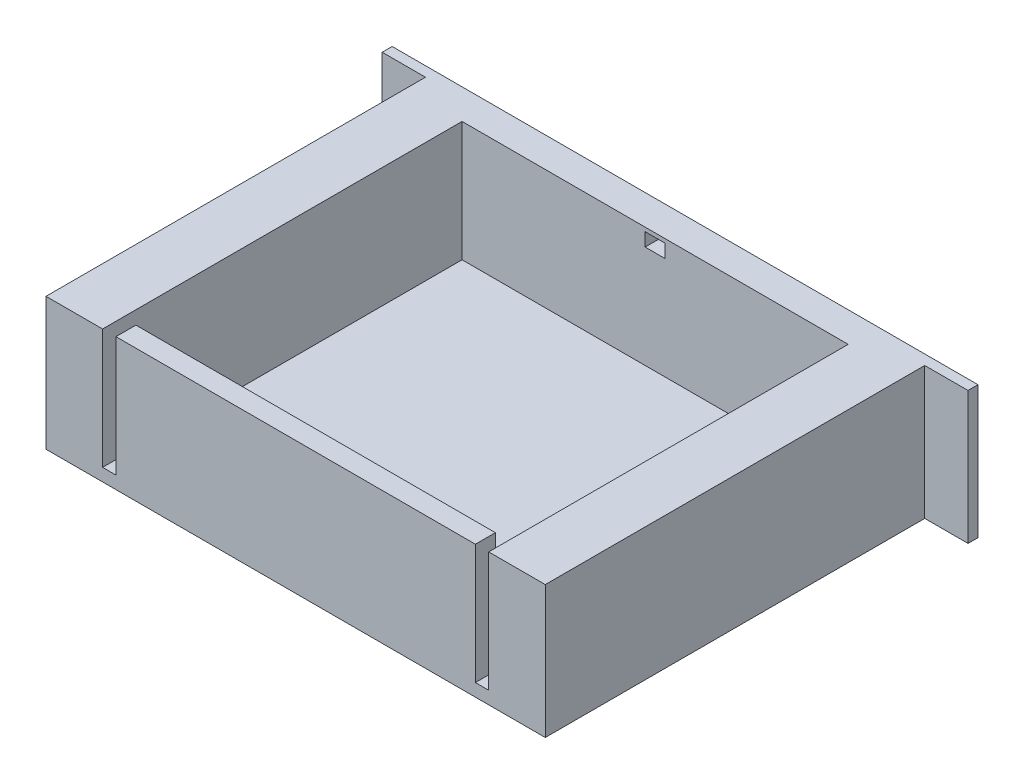
ISO-10303-21;
HEADER;
FILE_DESCRIPTION(('STEP AP214'),'2;1');
FILE_NAME('part.step','',(''),(''),'','','');
FILE_SCHEMA(('AUTOMOTIVE_DESIGN { 1 0 10303 214 1 1 1 1 }'));
ENDSEC;
DATA;
#1=APPLICATION_CONTEXT('core data for automotive mechanical design processes');
#2=APPLICATION_PROTOCOL_DEFINITION('international standard','automotive_design',2000,#1);
#3=PRODUCT_CONTEXT('',#1,'mechanical');
#4=PRODUCT('Part','Part','',(#3));
#5=PRODUCT_RELATED_PRODUCT_CATEGORY('part','',(#4));
#6=PRODUCT_DEFINITION_FORMATION('','',#4);
#7=PRODUCT_DEFINITION_CONTEXT('part definition',#1,'design');
#8=PRODUCT_DEFINITION('design','',#6,#7);
#9=PRODUCT_DEFINITION_SHAPE('','',#8);
#10=(LENGTH_UNIT() NAMED_UNIT(*) SI_UNIT(.MILLI.,.METRE.));
#11=(NAMED_UNIT(*) PLANE_ANGLE_UNIT() SI_UNIT($,.RADIAN.));
#12=(NAMED_UNIT(*) SI_UNIT($,.STERADIAN.) SOLID_ANGLE_UNIT());
#13=UNCERTAINTY_MEASURE_WITH_UNIT(LENGTH_MEASURE(1.E-05),#10,'distance_accuracy_value','');
#14=(GEOMETRIC_REPRESENTATION_CONTEXT(3) GLOBAL_UNCERTAINTY_ASSIGNED_CONTEXT((#13)) GLOBAL_UNIT_ASSIGNED_CONTEXT((#10,
#11,#12)) REPRESENTATION_CONTEXT('',''));
#15=CARTESIAN_POINT('',(0.,0.,0.));
#16=DIRECTION('',(0.,0.,1.));
#17=DIRECTION('',(1.,0.,0.));
#18=AXIS2_PLACEMENT_3D('',#15,#16,#17);
#19=CARTESIAN_POINT('',(-37.5031973116039,3.,-1.49999999999999));
#20=DIRECTION('',(0.,-1.,0.));
#21=DIRECTION('',(1.,0.,0.));
#22=AXIS2_PLACEMENT_3D('',#19,#20,#21);
#23=CYLINDRICAL_SURFACE('',#22,7.5);
#24=CARTESIAN_POINT('',(-37.5031973116039,0.,-1.49999999999999));
#25=DIRECTION('',(0.,-1.,0.));
#26=DIRECTION('',(-1.,0.,0.));
#27=AXIS2_PLACEMENT_3D('',#24,#25,#26);
#28=CIRCLE('',#27,7.5);
#29=CARTESIAN_POINT('',(-45.0031973116039,0.,-1.5));
#30=VERTEX_POINT('',#29);
#31=CARTESIAN_POINT('',(-30.0031973116039,0.,-1.49999999999999));
#32=VERTEX_POINT('',#31);
#33=EDGE_CURVE('E109',#30,#32,#28,.T.);
#34=ORIENTED_EDGE('',*,*,#33,.F.);
#35=DIRECTION('',(0.,-1.,0.));
#36=VECTOR('',#35,1.);
#37=CARTESIAN_POINT('',(-45.0031973116039,2.99999999999999,-1.5));
#38=LINE('',#37,#36);
#39=CARTESIAN_POINT('',(-45.0031973116039,2.99999999999999,-1.5));
#40=VERTEX_POINT('',#39);
#41=EDGE_CURVE('E12',#40,#30,#38,.T.);
#42=ORIENTED_EDGE('',*,*,#41,.F.);
#43=CARTESIAN_POINT('',(-37.5031973116039,3.,-1.49999999999999));
#44=DIRECTION('',(0.,-1.,0.));
#45=DIRECTION('',(-1.,0.,0.));
#46=AXIS2_PLACEMENT_3D('',#43,#44,#45);
#47=CIRCLE('',#46,7.5);
#48=CARTESIAN_POINT('',(-30.0031973116039,3.,-1.49999999999999));
#49=VERTEX_POINT('',#48);
#50=EDGE_CURVE('E103',#40,#49,#47,.T.);
#51=ORIENTED_EDGE('',*,*,#50,.T.);
#52=DIRECTION('',(0.,-1.,0.));
#53=VECTOR('',#52,1.);
#54=CARTESIAN_POINT('',(-30.0031973116039,3.,-1.49999999999999));
#55=LINE('',#54,#53);
#56=EDGE_CURVE('E48',#49,#32,#55,.T.);
#57=ORIENTED_EDGE('',*,*,#56,.T.);
#58=EDGE_LOOP('',(#34,#42,#51,#57));
#59=FACE_BOUND('',#58,.T.);
#60=ADVANCED_FACE('F45',(#59),#23,.T.);
#61=CARTESIAN_POINT('',(-42.5031973116039,2.99999999999999,-1.5));
#62=DIRECTION('',(0.,0.,1.));
#63=DIRECTION('',(1.,0.,0.));
#64=AXIS2_PLACEMENT_3D('',#61,#62,#63);
#65=PLANE('',#64);
#66=DIRECTION('',(-1.,0.,0.));
#67=VECTOR('',#66,1.);
#68=CARTESIAN_POINT('',(-42.5031973116039,0.,-1.5));
#69=LINE('',#68,#67);
#70=CARTESIAN_POINT('',(-42.5031973116039,0.,-1.49999999999999));
#71=VERTEX_POINT('',#70);
#72=EDGE_CURVE('E105',#71,#30,#69,.T.);
#73=ORIENTED_EDGE('',*,*,#72,.F.);
#74=DIRECTION('',(0.,-1.,0.));
#75=VECTOR('',#74,1.);
#76=CARTESIAN_POINT('',(-42.5031973116039,2.99999999999999,-1.49999999999999));
#77=LINE('',#76,#75);
#78=CARTESIAN_POINT('',(-42.5031973116039,2.99999999999999,-1.49999999999999));
#79=VERTEX_POINT('',#78);
#80=EDGE_CURVE('E54',#79,#71,#77,.T.);
#81=ORIENTED_EDGE('',*,*,#80,.F.);
#82=DIRECTION('',(-1.,0.,0.));
#83=VECTOR('',#82,1.);
#84=CARTESIAN_POINT('',(-42.5031973116039,2.99999999999999,-1.5));
#85=LINE('',#84,#83);
#86=EDGE_CURVE('E100',#79,#40,#85,.T.);
#87=ORIENTED_EDGE('',*,*,#86,.T.);
#88=ORIENTED_EDGE('',*,*,#41,.T.);
#89=EDGE_LOOP('',(#73,#81,#87,#88));
#90=FACE_BOUND('',#89,.T.);
#91=ADVANCED_FACE('F119',(#90),#65,.T.);
#92=CARTESIAN_POINT('',(-37.5031973116039,3.,-1.49999999999999));
#93=DIRECTION('',(0.,-1.,0.));
#94=DIRECTION('',(1.,0.,0.));
#95=AXIS2_PLACEMENT_3D('',#92,#93,#94);
#96=CYLINDRICAL_SURFACE('',#95,5.);
#97=CARTESIAN_POINT('',(-37.5031973116039,0.,-1.49999999999999));
#98=DIRECTION('',(0.,1.,0.));
#99=DIRECTION('',(-1.,0.,0.));
#100=AXIS2_PLACEMENT_3D('',#97,#98,#99);
#101=CIRCLE('',#100,5.);
#102=CARTESIAN_POINT('',(-32.5031973116039,0.,-1.49999999999999));
#103=VERTEX_POINT('',#102);
#104=EDGE_CURVE('E95',#103,#71,#101,.T.);
#105=ORIENTED_EDGE('',*,*,#104,.F.);
#106=DIRECTION('',(0.,-1.,0.));
#107=VECTOR('',#106,1.);
#108=CARTESIAN_POINT('',(-32.5031973116039,3.,-1.49999999999999));
#109=LINE('',#108,#107);
#110=CARTESIAN_POINT('',(-32.5031973116039,3.,-1.49999999999999));
#111=VERTEX_POINT('',#110);
#112=EDGE_CURVE('E90',#111,#103,#109,.T.);
#113=ORIENTED_EDGE('',*,*,#112,.F.);
#114=CARTESIAN_POINT('',(-37.5031973116039,3.,-1.49999999999999));
#115=DIRECTION('',(0.,1.,0.));
#116=DIRECTION('',(-1.,0.,0.));
#117=AXIS2_PLACEMENT_3D('',#114,#115,#116);
#118=CIRCLE('',#117,5.);
#119=EDGE_CURVE('E93',#111,#79,#118,.T.);
#120=ORIENTED_EDGE('',*,*,#119,.T.);
#121=ORIENTED_EDGE('',*,*,#80,.T.);
#122=EDGE_LOOP('',(#105,#113,#120,#121));
#123=FACE_BOUND('',#122,.T.);
#124=ADVANCED_FACE('F92',(#123),#96,.F.);
#125=CARTESIAN_POINT('',(-30.0031973116039,3.,-1.49999999999999));
#126=DIRECTION('',(0.,0.,1.));
#127=DIRECTION('',(1.,0.,0.));
#128=AXIS2_PLACEMENT_3D('',#125,#126,#127);
#129=PLANE('',#128);
#130=DIRECTION('',(-1.,0.,0.));
#131=VECTOR('',#130,1.);
#132=CARTESIAN_POINT('',(-30.0031973116039,0.,-1.49999999999999));
#133=LINE('',#132,#131);
#134=EDGE_CURVE('E112',#32,#103,#133,.T.);
#135=ORIENTED_EDGE('',*,*,#134,.F.);
#136=ORIENTED_EDGE('',*,*,#56,.F.);
#137=DIRECTION('',(-1.,0.,0.));
#138=VECTOR('',#137,1.);
#139=CARTESIAN_POINT('',(-30.0031973116039,3.,-1.49999999999999));
#140=LINE('',#139,#138);
#141=EDGE_CURVE('E99',#49,#111,#140,.T.);
#142=ORIENTED_EDGE('',*,*,#141,.T.);
#143=ORIENTED_EDGE('',*,*,#112,.T.);
#144=EDGE_LOOP('',(#135,#136,#142,#143));
#145=FACE_BOUND('',#144,.T.);
#146=ADVANCED_FACE('F102',(#145),#129,.T.);
#147=CARTESIAN_POINT('',(-37.5031973116039,3.,-1.49999999999999));
#148=DIRECTION('',(0.,1.,0.));
#149=DIRECTION('',(-1.,0.,0.));
#150=AXIS2_PLACEMENT_3D('',#147,#148,#149);
#151=PLANE('',#150);
#152=ORIENTED_EDGE('',*,*,#50,.F.);
#153=ORIENTED_EDGE('',*,*,#86,.F.);
#154=ORIENTED_EDGE('',*,*,#119,.F.);
#155=ORIENTED_EDGE('',*,*,#141,.F.);
#156=EDGE_LOOP('',(#152,#153,#154,#155));
#157=FACE_BOUND('',#156,.T.);
#158=ADVANCED_FACE('F98',(#157),#151,.T.);
#159=CARTESIAN_POINT('',(-37.5031973116039,0.,-1.49999999999999));
#160=DIRECTION('',(0.,1.,0.));
#161=DIRECTION('',(-1.,0.,0.));
#162=AXIS2_PLACEMENT_3D('',#159,#160,#161);
#163=PLANE('',#162);
#164=ORIENTED_EDGE('',*,*,#33,.T.);
#165=ORIENTED_EDGE('',*,*,#134,.T.);
#166=ORIENTED_EDGE('',*,*,#104,.T.);
#167=ORIENTED_EDGE('',*,*,#72,.T.);
#168=EDGE_LOOP('',(#164,#165,#166,#167));
#169=FACE_BOUND('',#168,.T.);
#170=ADVANCED_FACE('F118',(#169),#163,.F.);
#171=CLOSED_SHELL('',(#60,#91,#124,#146,#158,#170));
#172=MANIFOLD_SOLID_BREP('B2',#171);
#173=CARTESIAN_POINT('',(0.,19.9,57.));
#174=DIRECTION('',(0.,-1.,0.));
#175=DIRECTION('',(1.,0.,0.));
#176=AXIS2_PLACEMENT_3D('',#173,#174,#175);
#177=PLANE('',#176);
#178=DIRECTION('',(0.,0.,-1.));
#179=VECTOR('',#178,1.);
#180=CARTESIAN_POINT('',(-8.5,19.9,54.));
#181=LINE('',#180,#179);
#182=CARTESIAN_POINT('',(-8.5,19.9,57.));
#183=VERTEX_POINT('',#182);
#184=CARTESIAN_POINT('',(-8.49999999999999,19.9,3.));
#185=VERTEX_POINT('',#184);
#186=EDGE_CURVE('E341',#183,#185,#181,.T.);
#187=ORIENTED_EDGE('',*,*,#186,.F.);
#188=DIRECTION('',(-1.,0.,0.));
#189=VECTOR('',#188,1.);
#190=CARTESIAN_POINT('',(0.,19.9,57.));
#191=LINE('',#190,#189);
#192=CARTESIAN_POINT('',(0.,19.9,57.));
#193=VERTEX_POINT('',#192);
#194=EDGE_CURVE('E430',#193,#183,#191,.T.);
#195=ORIENTED_EDGE('',*,*,#194,.F.);
#196=DIRECTION('',(0.,0.,-1.));
#197=VECTOR('',#196,1.);
#198=CARTESIAN_POINT('',(0.,19.9,57.));
#199=LINE('',#198,#197);
#200=CARTESIAN_POINT('',(0.,19.9,0.));
#201=VERTEX_POINT('',#200);
#202=EDGE_CURVE('E43',#193,#201,#199,.T.);
#203=ORIENTED_EDGE('',*,*,#202,.T.);
#204=DIRECTION('',(1.,0.,0.));
#205=VECTOR('',#204,1.);
#206=CARTESIAN_POINT('',(6.5,19.9,0.));
#207=LINE('',#206,#205);
#208=CARTESIAN_POINT('',(6.5,19.9,0.));
#209=VERTEX_POINT('',#208);
#210=EDGE_CURVE('E410',#201,#209,#207,.T.);
#211=ORIENTED_EDGE('',*,*,#210,.T.);
#212=DIRECTION('',(0.,0.,1.));
#213=VECTOR('',#212,1.);
#214=CARTESIAN_POINT('',(6.5,19.9,-1.5));
#215=LINE('',#214,#213);
#216=CARTESIAN_POINT('',(6.5,19.9,-1.5));
#217=VERTEX_POINT('',#216);
#218=EDGE_CURVE('E401',#217,#209,#215,.T.);
#219=ORIENTED_EDGE('',*,*,#218,.F.);
#220=DIRECTION('',(1.,0.,0.));
#221=VECTOR('',#220,1.);
#222=CARTESIAN_POINT('',(6.5,19.9,-1.5));
#223=LINE('',#222,#221);
#224=CARTESIAN_POINT('',(-81.5,19.9,-1.5));
#225=VERTEX_POINT('',#224);
#226=EDGE_CURVE('E399',#225,#217,#223,.T.);
#227=ORIENTED_EDGE('',*,*,#226,.F.);
#228=DIRECTION('',(0.,0.,1.));
#229=VECTOR('',#228,1.);
#230=CARTESIAN_POINT('',(-81.5,19.9,-1.5));
#231=LINE('',#230,#229);
#232=CARTESIAN_POINT('',(-81.5,19.9,0.));
#233=VERTEX_POINT('',#232);
#234=EDGE_CURVE('E415',#225,#233,#231,.T.);
#235=ORIENTED_EDGE('',*,*,#234,.T.);
#236=CARTESIAN_POINT('',(-75.,19.9,0.));
#237=VERTEX_POINT('',#236);
#238=EDGE_CURVE('E395',#233,#237,#207,.T.);
#239=ORIENTED_EDGE('',*,*,#238,.T.);
#240=DIRECTION('',(0.,0.,-1.));
#241=VECTOR('',#240,1.);
#242=CARTESIAN_POINT('',(-75.,19.9,57.));
#243=LINE('',#242,#241);
#244=CARTESIAN_POINT('',(-75.,19.9,57.));
#245=VERTEX_POINT('',#244);
#246=EDGE_CURVE('E177',#245,#237,#243,.T.);
#247=ORIENTED_EDGE('',*,*,#246,.F.);
#248=CARTESIAN_POINT('',(-66.5,19.9,57.));
#249=VERTEX_POINT('',#248);
#250=EDGE_CURVE('E428',#249,#245,#191,.T.);
#251=ORIENTED_EDGE('',*,*,#250,.F.);
#252=DIRECTION('',(0.,0.,1.));
#253=VECTOR('',#252,1.);
#254=CARTESIAN_POINT('',(-66.5,19.9,54.));
#255=LINE('',#254,#253);
#256=CARTESIAN_POINT('',(-66.5,19.9,3.));
#257=VERTEX_POINT('',#256);
#258=EDGE_CURVE('E382',#257,#249,#255,.T.);
#259=ORIENTED_EDGE('',*,*,#258,.F.);
#260=DIRECTION('',(-1.,0.,0.));
#261=VECTOR('',#260,1.);
#262=CARTESIAN_POINT('',(-8.49999999999999,19.9,3.));
#263=LINE('',#262,#261);
#264=EDGE_CURVE('E379',#185,#257,#263,.T.);
#265=ORIENTED_EDGE('',*,*,#264,.F.);
#266=EDGE_LOOP('',(#187,#195,#203,#211,#219,#227,#235,#239,#247,#251,#259,#265));
#267=FACE_BOUND('',#266,.T.);
#268=ADVANCED_FACE('F169',(#267),#177,.F.);
#269=CARTESIAN_POINT('',(0.,0.,57.));
#270=DIRECTION('',(-1.,0.,0.));
#271=DIRECTION('',(0.,-1.,0.));
#272=AXIS2_PLACEMENT_3D('',#269,#270,#271);
#273=PLANE('',#272);
#274=DIRECTION('',(0.,1.,0.));
#275=VECTOR('',#274,1.);
#276=CARTESIAN_POINT('',(0.,0.,0.));
#277=LINE('',#276,#275);
#278=CARTESIAN_POINT('',(0.,0.,0.));
#279=VERTEX_POINT('',#278);
#280=EDGE_CURVE('E424',#279,#201,#277,.T.);
#281=ORIENTED_EDGE('',*,*,#280,.T.);
#282=ORIENTED_EDGE('',*,*,#202,.F.);
#283=DIRECTION('',(0.,1.,0.));
#284=VECTOR('',#283,1.);
#285=CARTESIAN_POINT('',(0.,0.,57.));
#286=LINE('',#285,#284);
#287=CARTESIAN_POINT('',(0.,0.,57.));
#288=VERTEX_POINT('',#287);
#289=EDGE_CURVE('E425',#288,#193,#286,.T.);
#290=ORIENTED_EDGE('',*,*,#289,.F.);
#291=DIRECTION('',(0.,0.,-1.));
#292=VECTOR('',#291,1.);
#293=CARTESIAN_POINT('',(0.,0.,57.));
#294=LINE('',#293,#292);
#295=EDGE_CURVE('E438',#288,#279,#294,.T.);
#296=ORIENTED_EDGE('',*,*,#295,.T.);
#297=EDGE_LOOP('',(#281,#282,#290,#296));
#298=FACE_BOUND('',#297,.T.);
#299=ADVANCED_FACE('F171',(#298),#273,.F.);
#300=CARTESIAN_POINT('',(-10.5,19.9,57.));
#301=VERTEX_POINT('',#300);
#302=CARTESIAN_POINT('',(-64.5,19.9,57.));
#303=VERTEX_POINT('',#302);
#304=EDGE_CURVE('E434',#301,#303,#191,.T.);
#305=ORIENTED_EDGE('',*,*,#304,.F.);
#306=DIRECTION('',(0.,0.,1.));
#307=VECTOR('',#306,1.);
#308=CARTESIAN_POINT('',(-10.5,19.9,54.));
#309=LINE('',#308,#307);
#310=CARTESIAN_POINT('',(-10.5,19.9,54.));
#311=VERTEX_POINT('',#310);
#312=EDGE_CURVE('E342',#311,#301,#309,.T.);
#313=ORIENTED_EDGE('',*,*,#312,.F.);
#314=DIRECTION('',(1.,0.,0.));
#315=VECTOR('',#314,1.);
#316=CARTESIAN_POINT('',(-8.5,19.9,54.));
#317=LINE('',#316,#315);
#318=CARTESIAN_POINT('',(-64.5,19.9,54.));
#319=VERTEX_POINT('',#318);
#320=EDGE_CURVE('E369',#319,#311,#317,.T.);
#321=ORIENTED_EDGE('',*,*,#320,.F.);
#322=DIRECTION('',(0.,0.,-1.));
#323=VECTOR('',#322,1.);
#324=CARTESIAN_POINT('',(-64.5,19.9,54.));
#325=LINE('',#324,#323);
#326=EDGE_CURVE('E334',#303,#319,#325,.T.);
#327=ORIENTED_EDGE('',*,*,#326,.F.);
#328=EDGE_LOOP('',(#305,#313,#321,#327));
#329=FACE_BOUND('',#328,.T.);
#330=ADVANCED_FACE('F494',(#329),#177,.F.);
#331=CARTESIAN_POINT('',(-75.,0.,57.));
#332=DIRECTION('',(1.,0.,0.));
#333=DIRECTION('',(0.,0.,-1.));
#334=AXIS2_PLACEMENT_3D('',#331,#332,#333);
#335=PLANE('',#334);
#336=DIRECTION('',(0.,-1.,0.));
#337=VECTOR('',#336,1.);
#338=CARTESIAN_POINT('',(-75.,0.,0.));
#339=LINE('',#338,#337);
#340=CARTESIAN_POINT('',(-75.,0.,0.));
#341=VERTEX_POINT('',#340);
#342=EDGE_CURVE('E429',#237,#341,#339,.T.);
#343=ORIENTED_EDGE('',*,*,#342,.T.);
#344=DIRECTION('',(0.,0.,-1.));
#345=VECTOR('',#344,1.);
#346=CARTESIAN_POINT('',(-75.,0.,57.));
#347=LINE('',#346,#345);
#348=CARTESIAN_POINT('',(-75.,0.,57.));
#349=VERTEX_POINT('',#348);
#350=EDGE_CURVE('E445',#349,#341,#347,.T.);
#351=ORIENTED_EDGE('',*,*,#350,.F.);
#352=DIRECTION('',(0.,-1.,0.));
#353=VECTOR('',#352,1.);
#354=CARTESIAN_POINT('',(-75.,0.,57.));
#355=LINE('',#354,#353);
#356=EDGE_CURVE('E433',#245,#349,#355,.T.);
#357=ORIENTED_EDGE('',*,*,#356,.F.);
#358=ORIENTED_EDGE('',*,*,#246,.T.);
#359=EDGE_LOOP('',(#343,#351,#357,#358));
#360=FACE_BOUND('',#359,.T.);
#361=ADVANCED_FACE('F451',(#360),#335,.F.);
#362=CARTESIAN_POINT('',(0.,0.,57.));
#363=DIRECTION('',(0.,1.,0.));
#364=DIRECTION('',(-1.,0.,0.));
#365=AXIS2_PLACEMENT_3D('',#362,#363,#364);
#366=PLANE('',#365);
#367=ORIENTED_EDGE('',*,*,#350,.T.);
#368=DIRECTION('',(-1.,0.,0.));
#369=VECTOR('',#368,1.);
#370=CARTESIAN_POINT('',(6.5,0.,0.));
#371=LINE('',#370,#369);
#372=CARTESIAN_POINT('',(-81.5,0.,0.));
#373=VERTEX_POINT('',#372);
#374=EDGE_CURVE('E404',#341,#373,#371,.T.);
#375=ORIENTED_EDGE('',*,*,#374,.T.);
#376=DIRECTION('',(0.,0.,1.));
#377=VECTOR('',#376,1.);
#378=CARTESIAN_POINT('',(-81.5,0.,-1.5));
#379=LINE('',#378,#377);
#380=CARTESIAN_POINT('',(-81.5,0.,-1.5));
#381=VERTEX_POINT('',#380);
#382=EDGE_CURVE('E418',#381,#373,#379,.T.);
#383=ORIENTED_EDGE('',*,*,#382,.F.);
#384=DIRECTION('',(-1.,0.,0.));
#385=VECTOR('',#384,1.);
#386=CARTESIAN_POINT('',(6.5,0.,-1.5));
#387=LINE('',#386,#385);
#388=CARTESIAN_POINT('',(6.5,0.,-1.5));
#389=VERTEX_POINT('',#388);
#390=EDGE_CURVE('E394',#389,#381,#387,.T.);
#391=ORIENTED_EDGE('',*,*,#390,.F.);
#392=DIRECTION('',(0.,0.,1.));
#393=VECTOR('',#392,1.);
#394=CARTESIAN_POINT('',(6.5,0.,-1.5));
#395=LINE('',#394,#393);
#396=CARTESIAN_POINT('',(6.5,0.,0.));
#397=VERTEX_POINT('',#396);
#398=EDGE_CURVE('E421',#389,#397,#395,.T.);
#399=ORIENTED_EDGE('',*,*,#398,.T.);
#400=EDGE_CURVE('E405',#397,#279,#371,.T.);
#401=ORIENTED_EDGE('',*,*,#400,.T.);
#402=ORIENTED_EDGE('',*,*,#295,.F.);
#403=DIRECTION('',(1.,0.,0.));
#404=VECTOR('',#403,1.);
#405=CARTESIAN_POINT('',(0.,0.,57.));
#406=LINE('',#405,#404);
#407=EDGE_CURVE('E436',#349,#288,#406,.T.);
#408=ORIENTED_EDGE('',*,*,#407,.F.);
#409=EDGE_LOOP('',(#367,#375,#383,#391,#399,#401,#402,#408));
#410=FACE_BOUND('',#409,.T.);
#411=ADVANCED_FACE('F464',(#410),#366,.F.);
#412=CARTESIAN_POINT('',(0.,0.,57.));
#413=DIRECTION('',(0.,0.,1.));
#414=DIRECTION('',(1.,0.,0.));
#415=AXIS2_PLACEMENT_3D('',#412,#413,#414);
#416=PLANE('',#415);
#417=DIRECTION('',(0.,1.,0.));
#418=VECTOR('',#417,1.);
#419=CARTESIAN_POINT('',(-8.5,-1.70555127546398,57.));
#420=LINE('',#419,#418);
#421=CARTESIAN_POINT('',(-8.5,1.9,57.));
#422=VERTEX_POINT('',#421);
#423=EDGE_CURVE('E338',#422,#183,#420,.T.);
#424=ORIENTED_EDGE('',*,*,#423,.F.);
#425=DIRECTION('',(-1.,0.,0.));
#426=VECTOR('',#425,1.);
#427=CARTESIAN_POINT('',(-8.5,1.9,57.));
#428=LINE('',#427,#426);
#429=CARTESIAN_POINT('',(-10.5,1.9,57.));
#430=VERTEX_POINT('',#429);
#431=EDGE_CURVE('E337',#422,#430,#428,.T.);
#432=ORIENTED_EDGE('',*,*,#431,.T.);
#433=DIRECTION('',(0.,1.,0.));
#434=VECTOR('',#433,1.);
#435=CARTESIAN_POINT('',(-10.5,-1.70555127546398,57.));
#436=LINE('',#435,#434);
#437=EDGE_CURVE('E348',#430,#301,#436,.T.);
#438=ORIENTED_EDGE('',*,*,#437,.T.);
#439=ORIENTED_EDGE('',*,*,#304,.T.);
#440=DIRECTION('',(0.,1.,0.));
#441=VECTOR('',#440,1.);
#442=CARTESIAN_POINT('',(-64.5,-1.70555127546398,57.));
#443=LINE('',#442,#441);
#444=CARTESIAN_POINT('',(-64.5,1.90000000000001,57.));
#445=VERTEX_POINT('',#444);
#446=EDGE_CURVE('E361',#445,#303,#443,.T.);
#447=ORIENTED_EDGE('',*,*,#446,.F.);
#448=DIRECTION('',(-1.,0.,0.));
#449=VECTOR('',#448,1.);
#450=CARTESIAN_POINT('',(-66.5,1.90000000000001,57.));
#451=LINE('',#450,#449);
#452=CARTESIAN_POINT('',(-66.5,1.90000000000001,57.));
#453=VERTEX_POINT('',#452);
#454=EDGE_CURVE('E352',#445,#453,#451,.T.);
#455=ORIENTED_EDGE('',*,*,#454,.T.);
#456=DIRECTION('',(0.,1.,0.));
#457=VECTOR('',#456,1.);
#458=CARTESIAN_POINT('',(-66.5,-1.70555127546398,57.));
#459=LINE('',#458,#457);
#460=EDGE_CURVE('E358',#453,#249,#459,.T.);
#461=ORIENTED_EDGE('',*,*,#460,.T.);
#462=ORIENTED_EDGE('',*,*,#250,.T.);
#463=ORIENTED_EDGE('',*,*,#356,.T.);
#464=ORIENTED_EDGE('',*,*,#407,.T.);
#465=ORIENTED_EDGE('',*,*,#289,.T.);
#466=ORIENTED_EDGE('',*,*,#194,.T.);
#467=EDGE_LOOP('',(#424,#432,#438,#439,#447,#455,#461,#462,#463,#464,#465,#466));
#468=FACE_BOUND('',#467,.T.);
#469=ADVANCED_FACE('F485',(#468),#416,.T.);
#470=CARTESIAN_POINT('',(0.,0.,0.));
#471=DIRECTION('',(0.,0.,-1.));
#472=DIRECTION('',(-1.,0.,0.));
#473=AXIS2_PLACEMENT_3D('',#470,#471,#472);
#474=PLANE('',#473);
#475=ORIENTED_EDGE('',*,*,#280,.F.);
#476=ORIENTED_EDGE('',*,*,#400,.F.);
#477=DIRECTION('',(0.,-1.,0.));
#478=VECTOR('',#477,1.);
#479=CARTESIAN_POINT('',(6.5,19.9,0.));
#480=LINE('',#479,#478);
#481=EDGE_CURVE('E388',#209,#397,#480,.T.);
#482=ORIENTED_EDGE('',*,*,#481,.F.);
#483=ORIENTED_EDGE('',*,*,#210,.F.);
#484=EDGE_LOOP('',(#475,#476,#482,#483));
#485=FACE_BOUND('',#484,.T.);
#486=ADVANCED_FACE('F479',(#485),#474,.F.);
#487=CARTESIAN_POINT('',(6.5,19.9,-1.5));
#488=DIRECTION('',(-1.,0.,0.));
#489=DIRECTION('',(0.,-1.,0.));
#490=AXIS2_PLACEMENT_3D('',#487,#488,#489);
#491=PLANE('',#490);
#492=ORIENTED_EDGE('',*,*,#481,.T.);
#493=ORIENTED_EDGE('',*,*,#398,.F.);
#494=DIRECTION('',(0.,-1.,0.));
#495=VECTOR('',#494,1.);
#496=CARTESIAN_POINT('',(6.5,19.9,-1.5));
#497=LINE('',#496,#495);
#498=EDGE_CURVE('E391',#217,#389,#497,.T.);
#499=ORIENTED_EDGE('',*,*,#498,.F.);
#500=ORIENTED_EDGE('',*,*,#218,.T.);
#501=EDGE_LOOP('',(#492,#493,#499,#500));
#502=FACE_BOUND('',#501,.T.);
#503=ADVANCED_FACE('F477',(#502),#491,.F.);
#504=CARTESIAN_POINT('',(-81.5,19.9,-1.5));
#505=DIRECTION('',(1.,0.,0.));
#506=DIRECTION('',(0.,0.,-1.));
#507=AXIS2_PLACEMENT_3D('',#504,#505,#506);
#508=PLANE('',#507);
#509=DIRECTION('',(0.,1.,0.));
#510=VECTOR('',#509,1.);
#511=CARTESIAN_POINT('',(-81.5,19.9,0.));
#512=LINE('',#511,#510);
#513=EDGE_CURVE('E408',#373,#233,#512,.T.);
#514=ORIENTED_EDGE('',*,*,#513,.T.);
#515=ORIENTED_EDGE('',*,*,#234,.F.);
#516=DIRECTION('',(0.,1.,0.));
#517=VECTOR('',#516,1.);
#518=CARTESIAN_POINT('',(-81.5,19.9,-1.5));
#519=LINE('',#518,#517);
#520=EDGE_CURVE('E397',#381,#225,#519,.T.);
#521=ORIENTED_EDGE('',*,*,#520,.F.);
#522=ORIENTED_EDGE('',*,*,#382,.T.);
#523=EDGE_LOOP('',(#514,#515,#521,#522));
#524=FACE_BOUND('',#523,.T.);
#525=ADVANCED_FACE('F468',(#524),#508,.F.);
#526=CARTESIAN_POINT('',(0.,0.,-1.5));
#527=DIRECTION('',(0.,0.,-1.));
#528=DIRECTION('',(-1.,0.,0.));
#529=AXIS2_PLACEMENT_3D('',#526,#527,#528);
#530=PLANE('',#529);
#531=DIRECTION('',(-1.,0.,0.));
#532=VECTOR('',#531,1.);
#533=CARTESIAN_POINT('',(-36.,17.3058398665404,-1.5));
#534=LINE('',#533,#532);
#535=CARTESIAN_POINT('',(-36.,17.3058398665404,-1.5));
#536=VERTEX_POINT('',#535);
#537=CARTESIAN_POINT('',(-39.,17.3058398665404,-1.5));
#538=VERTEX_POINT('',#537);
#539=EDGE_CURVE('E550',#536,#538,#534,.T.);
#540=ORIENTED_EDGE('',*,*,#539,.F.);
#541=DIRECTION('',(0.,-1.,0.));
#542=VECTOR('',#541,1.);
#543=CARTESIAN_POINT('',(-36.,19.3058398665404,-1.5));
#544=LINE('',#543,#542);
#545=CARTESIAN_POINT('',(-36.,19.3058398665404,-1.5));
#546=VERTEX_POINT('',#545);
#547=EDGE_CURVE('E326',#546,#536,#544,.T.);
#548=ORIENTED_EDGE('',*,*,#547,.F.);
#549=DIRECTION('',(1.,0.,0.));
#550=VECTOR('',#549,1.);
#551=CARTESIAN_POINT('',(-36.,19.3058398665404,-1.5));
#552=LINE('',#551,#550);
#553=CARTESIAN_POINT('',(-39.,19.3058398665404,-1.5));
#554=VERTEX_POINT('',#553);
#555=EDGE_CURVE('E184',#554,#546,#552,.T.);
#556=ORIENTED_EDGE('',*,*,#555,.F.);
#557=DIRECTION('',(0.,1.,0.));
#558=VECTOR('',#557,1.);
#559=CARTESIAN_POINT('',(-39.,19.3058398665404,-1.5));
#560=LINE('',#559,#558);
#561=EDGE_CURVE('E552',#538,#554,#560,.T.);
#562=ORIENTED_EDGE('',*,*,#561,.F.);
#563=EDGE_LOOP('',(#540,#548,#556,#562));
#564=FACE_BOUND('',#563,.T.);
#565=ORIENTED_EDGE('',*,*,#498,.T.);
#566=ORIENTED_EDGE('',*,*,#390,.T.);
#567=ORIENTED_EDGE('',*,*,#520,.T.);
#568=ORIENTED_EDGE('',*,*,#226,.T.);
#569=EDGE_LOOP('',(#565,#566,#567,#568));
#570=FACE_BOUND('',#569,.T.);
#571=ADVANCED_FACE('F470',(#564,#570),#530,.T.);
#572=ORIENTED_EDGE('',*,*,#342,.F.);
#573=ORIENTED_EDGE('',*,*,#238,.F.);
#574=ORIENTED_EDGE('',*,*,#513,.F.);
#575=ORIENTED_EDGE('',*,*,#374,.F.);
#576=EDGE_LOOP('',(#572,#573,#574,#575));
#577=FACE_BOUND('',#576,.T.);
#578=ADVANCED_FACE('F461',(#577),#474,.F.);
#579=CARTESIAN_POINT('',(-8.5,1.9,54.));
#580=DIRECTION('',(1.,0.,0.));
#581=DIRECTION('',(0.,0.,-1.));
#582=AXIS2_PLACEMENT_3D('',#579,#580,#581);
#583=PLANE('',#582);
#584=ORIENTED_EDGE('',*,*,#186,.T.);
#585=DIRECTION('',(0.,1.,0.));
#586=VECTOR('',#585,1.);
#587=CARTESIAN_POINT('',(-8.49999999999999,1.9,3.));
#588=LINE('',#587,#586);
#589=CARTESIAN_POINT('',(-8.49999999999999,1.9,3.));
#590=VERTEX_POINT('',#589);
#591=EDGE_CURVE('E377',#590,#185,#588,.T.);
#592=ORIENTED_EDGE('',*,*,#591,.F.);
#593=DIRECTION('',(0.,0.,-1.));
#594=VECTOR('',#593,1.);
#595=CARTESIAN_POINT('',(-8.5,1.9,54.));
#596=LINE('',#595,#594);
#597=EDGE_CURVE('E365',#422,#590,#596,.T.);
#598=ORIENTED_EDGE('',*,*,#597,.F.);
#599=ORIENTED_EDGE('',*,*,#423,.T.);
#600=EDGE_LOOP('',(#584,#592,#598,#599));
#601=FACE_BOUND('',#600,.T.);
#602=ADVANCED_FACE('F513',(#601),#583,.F.);
#603=CARTESIAN_POINT('',(-8.5,1.9,54.));
#604=DIRECTION('',(0.,0.,1.));
#605=DIRECTION('',(1.,0.,0.));
#606=AXIS2_PLACEMENT_3D('',#603,#604,#605);
#607=PLANE('',#606);
#608=ORIENTED_EDGE('',*,*,#320,.T.);
#609=DIRECTION('',(0.,1.,0.));
#610=VECTOR('',#609,1.);
#611=CARTESIAN_POINT('',(-10.5,-1.70555127546398,54.));
#612=LINE('',#611,#610);
#613=CARTESIAN_POINT('',(-10.5,1.9,54.));
#614=VERTEX_POINT('',#613);
#615=EDGE_CURVE('E344',#614,#311,#612,.T.);
#616=ORIENTED_EDGE('',*,*,#615,.F.);
#617=DIRECTION('',(1.,0.,0.));
#618=VECTOR('',#617,1.);
#619=CARTESIAN_POINT('',(-8.5,1.9,54.));
#620=LINE('',#619,#618);
#621=CARTESIAN_POINT('',(-64.5,1.90000000000001,54.));
#622=VERTEX_POINT('',#621);
#623=EDGE_CURVE('E374',#622,#614,#620,.T.);
#624=ORIENTED_EDGE('',*,*,#623,.F.);
#625=DIRECTION('',(0.,1.,0.));
#626=VECTOR('',#625,1.);
#627=CARTESIAN_POINT('',(-64.5,-1.70555127546398,54.));
#628=LINE('',#627,#626);
#629=EDGE_CURVE('E355',#622,#319,#628,.T.);
#630=ORIENTED_EDGE('',*,*,#629,.T.);
#631=EDGE_LOOP('',(#608,#616,#624,#630));
#632=FACE_BOUND('',#631,.T.);
#633=ADVANCED_FACE('F501',(#632),#607,.F.);
#634=CARTESIAN_POINT('',(-66.5,1.90000000000001,54.));
#635=DIRECTION('',(-1.,0.,0.));
#636=DIRECTION('',(0.,-1.,0.));
#637=AXIS2_PLACEMENT_3D('',#634,#635,#636);
#638=PLANE('',#637);
#639=ORIENTED_EDGE('',*,*,#258,.T.);
#640=ORIENTED_EDGE('',*,*,#460,.F.);
#641=DIRECTION('',(0.,0.,1.));
#642=VECTOR('',#641,1.);
#643=CARTESIAN_POINT('',(-66.5,1.90000000000001,54.));
#644=LINE('',#643,#642);
#645=CARTESIAN_POINT('',(-66.5,1.90000000000001,3.));
#646=VERTEX_POINT('',#645);
#647=EDGE_CURVE('E372',#646,#453,#644,.T.);
#648=ORIENTED_EDGE('',*,*,#647,.F.);
#649=DIRECTION('',(0.,1.,0.));
#650=VECTOR('',#649,1.);
#651=CARTESIAN_POINT('',(-66.5,1.90000000000001,3.));
#652=LINE('',#651,#650);
#653=EDGE_CURVE('E386',#646,#257,#652,.T.);
#654=ORIENTED_EDGE('',*,*,#653,.T.);
#655=EDGE_LOOP('',(#639,#640,#648,#654));
#656=FACE_BOUND('',#655,.T.);
#657=ADVANCED_FACE('F510',(#656),#638,.F.);
#658=CARTESIAN_POINT('',(-8.49999999999999,1.9,3.));
#659=DIRECTION('',(0.,0.,-1.));
#660=DIRECTION('',(-1.,0.,0.));
#661=AXIS2_PLACEMENT_3D('',#658,#659,#660);
#662=PLANE('',#661);
#663=DIRECTION('',(0.,1.,0.));
#664=VECTOR('',#663,1.);
#665=CARTESIAN_POINT('',(-36.,19.3058398665404,3.));
#666=LINE('',#665,#664);
#667=CARTESIAN_POINT('',(-36.,17.3058398665404,3.));
#668=VERTEX_POINT('',#667);
#669=CARTESIAN_POINT('',(-36.,19.3058398665404,3.00000000000001));
#670=VERTEX_POINT('',#669);
#671=EDGE_CURVE('E317',#668,#670,#666,.T.);
#672=ORIENTED_EDGE('',*,*,#671,.F.);
#673=DIRECTION('',(1.,0.,0.));
#674=VECTOR('',#673,1.);
#675=CARTESIAN_POINT('',(-36.,17.3058398665404,3.));
#676=LINE('',#675,#674);
#677=CARTESIAN_POINT('',(-39.,17.3058398665404,3.00000000000001));
#678=VERTEX_POINT('',#677);
#679=EDGE_CURVE('E192',#678,#668,#676,.T.);
#680=ORIENTED_EDGE('',*,*,#679,.F.);
#681=DIRECTION('',(0.,-1.,0.));
#682=VECTOR('',#681,1.);
#683=CARTESIAN_POINT('',(-39.,19.3058398665404,3.));
#684=LINE('',#683,#682);
#685=CARTESIAN_POINT('',(-39.,19.3058398665404,3.00000000000001));
#686=VERTEX_POINT('',#685);
#687=EDGE_CURVE('E324',#686,#678,#684,.T.);
#688=ORIENTED_EDGE('',*,*,#687,.F.);
#689=DIRECTION('',(-1.,0.,0.));
#690=VECTOR('',#689,1.);
#691=CARTESIAN_POINT('',(-36.,19.3058398665404,3.));
#692=LINE('',#691,#690);
#693=EDGE_CURVE('E308',#670,#686,#692,.T.);
#694=ORIENTED_EDGE('',*,*,#693,.F.);
#695=EDGE_LOOP('',(#672,#680,#688,#694));
#696=FACE_BOUND('',#695,.T.);
#697=ORIENTED_EDGE('',*,*,#264,.T.);
#698=ORIENTED_EDGE('',*,*,#653,.F.);
#699=DIRECTION('',(-1.,0.,0.));
#700=VECTOR('',#699,1.);
#701=CARTESIAN_POINT('',(-8.49999999999999,1.9,3.));
#702=LINE('',#701,#700);
#703=EDGE_CURVE('E368',#590,#646,#702,.T.);
#704=ORIENTED_EDGE('',*,*,#703,.F.);
#705=ORIENTED_EDGE('',*,*,#591,.T.);
#706=EDGE_LOOP('',(#697,#698,#704,#705));
#707=FACE_BOUND('',#706,.T.);
#708=ADVANCED_FACE('F321',(#696,#707),#662,.F.);
#709=CARTESIAN_POINT('',(0.,1.9,0.));
#710=DIRECTION('',(0.,1.,0.));
#711=DIRECTION('',(-1.,0.,0.));
#712=AXIS2_PLACEMENT_3D('',#709,#710,#711);
#713=PLANE('',#712);
#714=ORIENTED_EDGE('',*,*,#597,.T.);
#715=ORIENTED_EDGE('',*,*,#703,.T.);
#716=ORIENTED_EDGE('',*,*,#647,.T.);
#717=ORIENTED_EDGE('',*,*,#454,.F.);
#718=DIRECTION('',(0.,0.,1.));
#719=VECTOR('',#718,1.);
#720=CARTESIAN_POINT('',(-64.5,1.90000000000001,54.));
#721=LINE('',#720,#719);
#722=EDGE_CURVE('E345',#622,#445,#721,.T.);
#723=ORIENTED_EDGE('',*,*,#722,.F.);
#724=ORIENTED_EDGE('',*,*,#623,.T.);
#725=DIRECTION('',(0.,0.,-1.));
#726=VECTOR('',#725,1.);
#727=CARTESIAN_POINT('',(-10.5,1.9,54.));
#728=LINE('',#727,#726);
#729=EDGE_CURVE('E335',#430,#614,#728,.T.);
#730=ORIENTED_EDGE('',*,*,#729,.F.);
#731=ORIENTED_EDGE('',*,*,#431,.F.);
#732=EDGE_LOOP('',(#714,#715,#716,#717,#723,#724,#730,#731));
#733=FACE_BOUND('',#732,.T.);
#734=ADVANCED_FACE('F504',(#733),#713,.T.);
#735=CARTESIAN_POINT('',(-64.5,-1.70555127546398,54.));
#736=DIRECTION('',(1.,0.,0.));
#737=DIRECTION('',(0.,1.,0.));
#738=AXIS2_PLACEMENT_3D('',#735,#736,#737);
#739=PLANE('',#738);
#740=ORIENTED_EDGE('',*,*,#722,.T.);
#741=ORIENTED_EDGE('',*,*,#446,.T.);
#742=ORIENTED_EDGE('',*,*,#326,.T.);
#743=ORIENTED_EDGE('',*,*,#629,.F.);
#744=EDGE_LOOP('',(#740,#741,#742,#743));
#745=FACE_BOUND('',#744,.T.);
#746=ADVANCED_FACE('F497',(#745),#739,.F.);
#747=CARTESIAN_POINT('',(-10.5,-1.70555127546398,54.));
#748=DIRECTION('',(-1.,0.,0.));
#749=DIRECTION('',(0.,-1.,0.));
#750=AXIS2_PLACEMENT_3D('',#747,#748,#749);
#751=PLANE('',#750);
#752=ORIENTED_EDGE('',*,*,#729,.T.);
#753=ORIENTED_EDGE('',*,*,#615,.T.);
#754=ORIENTED_EDGE('',*,*,#312,.T.);
#755=ORIENTED_EDGE('',*,*,#437,.F.);
#756=EDGE_LOOP('',(#752,#753,#754,#755));
#757=FACE_BOUND('',#756,.T.);
#758=ADVANCED_FACE('F561',(#757),#751,.F.);
#759=CARTESIAN_POINT('',(-36.,17.3058398665404,57.001));
#760=DIRECTION('',(0.,-1.,0.));
#761=DIRECTION('',(0.,0.,-1.));
#762=AXIS2_PLACEMENT_3D('',#759,#760,#761);
#763=PLANE('',#762);
#764=ORIENTED_EDGE('',*,*,#679,.T.);
#765=DIRECTION('',(0.,0.,-1.));
#766=VECTOR('',#765,1.);
#767=CARTESIAN_POINT('',(-36.,17.3058398665404,57.001));
#768=LINE('',#767,#766);
#769=EDGE_CURVE('E313',#668,#536,#768,.T.);
#770=ORIENTED_EDGE('',*,*,#769,.T.);
#771=ORIENTED_EDGE('',*,*,#539,.T.);
#772=DIRECTION('',(0.,0.,-1.));
#773=VECTOR('',#772,1.);
#774=CARTESIAN_POINT('',(-39.,17.3058398665404,57.001));
#775=LINE('',#774,#773);
#776=EDGE_CURVE('E331',#678,#538,#775,.T.);
#777=ORIENTED_EDGE('',*,*,#776,.F.);
#778=EDGE_LOOP('',(#764,#770,#771,#777));
#779=FACE_BOUND('',#778,.T.);
#780=ADVANCED_FACE('F559',(#779),#763,.F.);
#781=CARTESIAN_POINT('',(-39.,19.3058398665404,57.001));
#782=DIRECTION('',(-1.,0.,0.));
#783=DIRECTION('',(0.,0.,1.));
#784=AXIS2_PLACEMENT_3D('',#781,#782,#783);
#785=PLANE('',#784);
#786=ORIENTED_EDGE('',*,*,#687,.T.);
#787=ORIENTED_EDGE('',*,*,#776,.T.);
#788=ORIENTED_EDGE('',*,*,#561,.T.);
#789=DIRECTION('',(0.,0.,-1.));
#790=VECTOR('',#789,1.);
#791=CARTESIAN_POINT('',(-39.,19.3058398665404,57.001));
#792=LINE('',#791,#790);
#793=EDGE_CURVE('E314',#686,#554,#792,.T.);
#794=ORIENTED_EDGE('',*,*,#793,.F.);
#795=EDGE_LOOP('',(#786,#787,#788,#794));
#796=FACE_BOUND('',#795,.T.);
#797=ADVANCED_FACE('F558',(#796),#785,.F.);
#798=CARTESIAN_POINT('',(-36.,19.3058398665404,57.001));
#799=DIRECTION('',(0.,1.,0.));
#800=DIRECTION('',(0.,0.,1.));
#801=AXIS2_PLACEMENT_3D('',#798,#799,#800);
#802=PLANE('',#801);
#803=ORIENTED_EDGE('',*,*,#693,.T.);
#804=ORIENTED_EDGE('',*,*,#793,.T.);
#805=ORIENTED_EDGE('',*,*,#555,.T.);
#806=DIRECTION('',(0.,0.,-1.));
#807=VECTOR('',#806,1.);
#808=CARTESIAN_POINT('',(-36.,19.3058398665404,57.001));
#809=LINE('',#808,#807);
#810=EDGE_CURVE('E304',#670,#546,#809,.T.);
#811=ORIENTED_EDGE('',*,*,#810,.F.);
#812=EDGE_LOOP('',(#803,#804,#805,#811));
#813=FACE_BOUND('',#812,.T.);
#814=ADVANCED_FACE('F306',(#813),#802,.F.);
#815=CARTESIAN_POINT('',(-36.,19.3058398665404,57.001));
#816=DIRECTION('',(1.,0.,0.));
#817=DIRECTION('',(0.,0.,-1.));
#818=AXIS2_PLACEMENT_3D('',#815,#816,#817);
#819=PLANE('',#818);
#820=ORIENTED_EDGE('',*,*,#671,.T.);
#821=ORIENTED_EDGE('',*,*,#810,.T.);
#822=ORIENTED_EDGE('',*,*,#547,.T.);
#823=ORIENTED_EDGE('',*,*,#769,.F.);
#824=EDGE_LOOP('',(#820,#821,#822,#823));
#825=FACE_BOUND('',#824,.T.);
#826=ADVANCED_FACE('F318',(#825),#819,.F.);
#827=CLOSED_SHELL('',(#268,#299,#330,#361,#411,#469,#486,#503,#525,#571,#578,#602,#633,#657,
#708,#734,#746,#758,#780,#797,#814,#826));
#828=MANIFOLD_SOLID_BREP('B6',#827);
#829=ADVANCED_BREP_SHAPE_REPRESENTATION('',(#18,#172,#828),#14);
#830=SHAPE_DEFINITION_REPRESENTATION(#9,#829);
ENDSEC;
END-ISO-10303-21;
